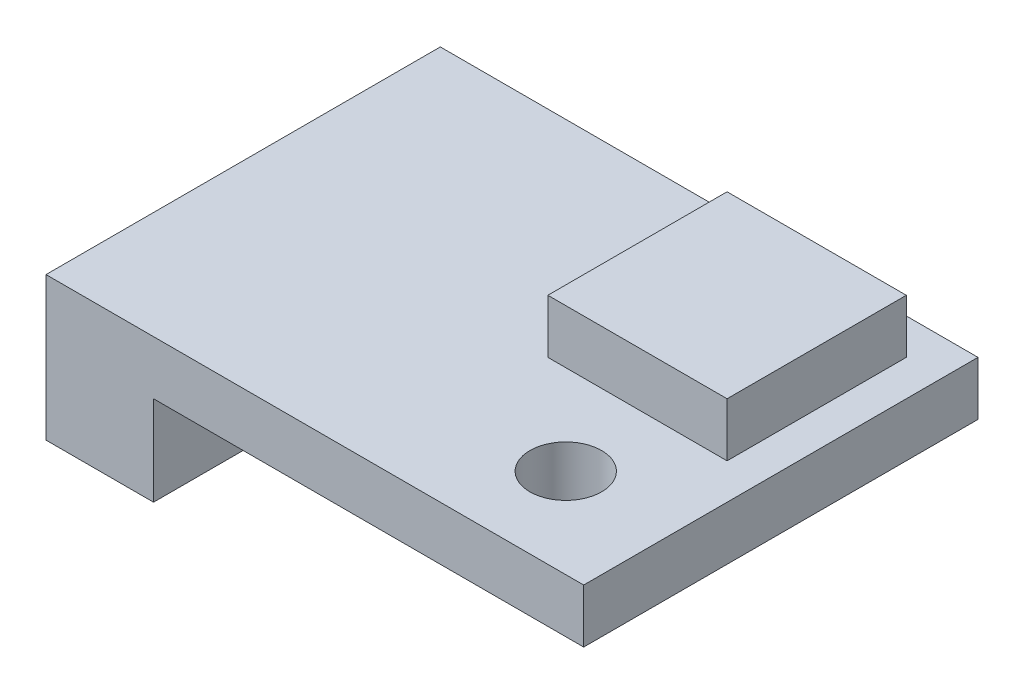
ISO-10303-21;
HEADER;
FILE_DESCRIPTION(('STEP AP214'),'2;1');
FILE_NAME('part.step','',(''),(''),'','','');
FILE_SCHEMA(('AUTOMOTIVE_DESIGN { 1 0 10303 214 1 1 1 1 }'));
ENDSEC;
DATA;
#1=APPLICATION_CONTEXT('core data for automotive mechanical design processes');
#2=APPLICATION_PROTOCOL_DEFINITION('international standard','automotive_design',2000,#1);
#3=PRODUCT_CONTEXT('',#1,'mechanical');
#4=PRODUCT('Part','Part','',(#3));
#5=PRODUCT_RELATED_PRODUCT_CATEGORY('part','',(#4));
#6=PRODUCT_DEFINITION_FORMATION('','',#4);
#7=PRODUCT_DEFINITION_CONTEXT('part definition',#1,'design');
#8=PRODUCT_DEFINITION('design','',#6,#7);
#9=PRODUCT_DEFINITION_SHAPE('','',#8);
#10=(LENGTH_UNIT() NAMED_UNIT(*) SI_UNIT(.MILLI.,.METRE.));
#11=(NAMED_UNIT(*) PLANE_ANGLE_UNIT() SI_UNIT($,.RADIAN.));
#12=(NAMED_UNIT(*) SI_UNIT($,.STERADIAN.) SOLID_ANGLE_UNIT());
#13=UNCERTAINTY_MEASURE_WITH_UNIT(LENGTH_MEASURE(1.E-05),#10,'distance_accuracy_value','');
#14=(GEOMETRIC_REPRESENTATION_CONTEXT(3) GLOBAL_UNCERTAINTY_ASSIGNED_CONTEXT((#13)) GLOBAL_UNIT_ASSIGNED_CONTEXT((#10,
#11,#12)) REPRESENTATION_CONTEXT('',''));
#15=CARTESIAN_POINT('',(0.,0.,0.));
#16=DIRECTION('',(0.,0.,1.));
#17=DIRECTION('',(1.,0.,0.));
#18=AXIS2_PLACEMENT_3D('',#15,#16,#17);
#19=CARTESIAN_POINT('',(0.,1.5,0.));
#20=DIRECTION('',(0.,1.,0.));
#21=DIRECTION('',(0.,0.,1.));
#22=AXIS2_PLACEMENT_3D('',#19,#20,#21);
#23=PLANE('',#22);
#24=DIRECTION('',(-1.,0.,0.));
#25=VECTOR('',#24,1.);
#26=CARTESIAN_POINT('',(0.,1.5,5.5));
#27=LINE('',#26,#25);
#28=CARTESIAN_POINT('',(7.5,1.5,5.5));
#29=VERTEX_POINT('',#28);
#30=CARTESIAN_POINT('',(-7.5,1.5,5.5));
#31=VERTEX_POINT('',#30);
#32=EDGE_CURVE('E198',#29,#31,#27,.T.);
#33=ORIENTED_EDGE('',*,*,#32,.F.);
#34=DIRECTION('',(0.,0.,1.));
#35=VECTOR('',#34,1.);
#36=CARTESIAN_POINT('',(7.5,1.5,0.));
#37=LINE('',#36,#35);
#38=CARTESIAN_POINT('',(7.5,1.5,-5.5));
#39=VERTEX_POINT('',#38);
#40=EDGE_CURVE('E202',#39,#29,#37,.T.);
#41=ORIENTED_EDGE('',*,*,#40,.F.);
#42=DIRECTION('',(-1.,0.,0.));
#43=VECTOR('',#42,1.);
#44=CARTESIAN_POINT('',(0.,1.5,-5.5));
#45=LINE('',#44,#43);
#46=CARTESIAN_POINT('',(-7.5,1.5,-5.5));
#47=VERTEX_POINT('',#46);
#48=EDGE_CURVE('E207',#39,#47,#45,.T.);
#49=ORIENTED_EDGE('',*,*,#48,.T.);
#50=DIRECTION('',(0.,0.,1.));
#51=VECTOR('',#50,1.);
#52=CARTESIAN_POINT('',(-7.5,1.5,0.));
#53=LINE('',#52,#51);
#54=EDGE_CURVE('E210',#47,#31,#53,.T.);
#55=ORIENTED_EDGE('',*,*,#54,.T.);
#56=EDGE_LOOP('',(#33,#41,#49,#55));
#57=FACE_BOUND('',#56,.T.);
#58=CARTESIAN_POINT('',(4.5,1.5,3.));
#59=DIRECTION('',(0.,1.,0.));
#60=DIRECTION('',(0.,0.,1.));
#61=AXIS2_PLACEMENT_3D('',#58,#59,#60);
#62=CIRCLE('',#61,1.);
#63=CARTESIAN_POINT('',(4.5,1.5,4.));
#64=VERTEX_POINT('',#63);
#65=EDGE_CURVE('E213',#64,#64,#62,.T.);
#66=ORIENTED_EDGE('',*,*,#65,.F.);
#67=EDGE_LOOP('',(#66));
#68=FACE_BOUND('',#67,.T.);
#69=DIRECTION('',(1.,0.,0.));
#70=VECTOR('',#69,1.);
#71=CARTESIAN_POINT('',(0.,1.5,-4.5));
#72=LINE('',#71,#70);
#73=CARTESIAN_POINT('',(1.5,1.5,-4.5));
#74=VERTEX_POINT('',#73);
#75=CARTESIAN_POINT('',(6.5,1.5,-4.5));
#76=VERTEX_POINT('',#75);
#77=EDGE_CURVE('E157',#74,#76,#72,.T.);
#78=ORIENTED_EDGE('',*,*,#77,.T.);
#79=DIRECTION('',(0.,0.,-1.));
#80=VECTOR('',#79,1.);
#81=CARTESIAN_POINT('',(6.5,1.5,0.));
#82=LINE('',#81,#80);
#83=CARTESIAN_POINT('',(6.5,1.5,0.499999999999998));
#84=VERTEX_POINT('',#83);
#85=EDGE_CURVE('E138',#84,#76,#82,.T.);
#86=ORIENTED_EDGE('',*,*,#85,.F.);
#87=DIRECTION('',(1.,0.,0.));
#88=VECTOR('',#87,1.);
#89=CARTESIAN_POINT('',(0.,1.5,0.499999999999999));
#90=LINE('',#89,#88);
#91=CARTESIAN_POINT('',(1.5,1.5,0.499999999999999));
#92=VERTEX_POINT('',#91);
#93=EDGE_CURVE('E132',#92,#84,#90,.T.);
#94=ORIENTED_EDGE('',*,*,#93,.F.);
#95=DIRECTION('',(0.,0.,-1.));
#96=VECTOR('',#95,1.);
#97=CARTESIAN_POINT('',(1.5,1.5,0.));
#98=LINE('',#97,#96);
#99=EDGE_CURVE('E57',#92,#74,#98,.T.);
#100=ORIENTED_EDGE('',*,*,#99,.T.);
#101=EDGE_LOOP('',(#78,#86,#94,#100));
#102=FACE_BOUND('',#101,.T.);
#103=ADVANCED_FACE('F41',(#57,#68,#102),#23,.T.);
#104=CARTESIAN_POINT('',(0.,0.,0.));
#105=DIRECTION('',(0.,1.,0.));
#106=DIRECTION('',(0.,0.,1.));
#107=AXIS2_PLACEMENT_3D('',#104,#105,#106);
#108=PLANE('',#107);
#109=CARTESIAN_POINT('',(4.5,0.,3.));
#110=DIRECTION('',(0.,1.,0.));
#111=DIRECTION('',(0.,0.,1.));
#112=AXIS2_PLACEMENT_3D('',#109,#110,#111);
#113=CIRCLE('',#112,1.);
#114=CARTESIAN_POINT('',(4.5,0.,4.));
#115=VERTEX_POINT('',#114);
#116=EDGE_CURVE('E203',#115,#115,#113,.T.);
#117=ORIENTED_EDGE('',*,*,#116,.T.);
#118=EDGE_LOOP('',(#117));
#119=FACE_BOUND('',#118,.T.);
#120=DIRECTION('',(0.,0.,1.));
#121=VECTOR('',#120,1.);
#122=CARTESIAN_POINT('',(-4.5,0.,0.));
#123=LINE('',#122,#121);
#124=CARTESIAN_POINT('',(-4.5,0.,-5.5));
#125=VERTEX_POINT('',#124);
#126=CARTESIAN_POINT('',(-4.5,0.,5.5));
#127=VERTEX_POINT('',#126);
#128=EDGE_CURVE('E65',#125,#127,#123,.T.);
#129=ORIENTED_EDGE('',*,*,#128,.F.);
#130=DIRECTION('',(-1.,0.,0.));
#131=VECTOR('',#130,1.);
#132=CARTESIAN_POINT('',(0.,0.,-5.5));
#133=LINE('',#132,#131);
#134=CARTESIAN_POINT('',(7.5,0.,-5.5));
#135=VERTEX_POINT('',#134);
#136=EDGE_CURVE('E224',#135,#125,#133,.T.);
#137=ORIENTED_EDGE('',*,*,#136,.F.);
#138=DIRECTION('',(0.,0.,1.));
#139=VECTOR('',#138,1.);
#140=CARTESIAN_POINT('',(7.5,0.,0.));
#141=LINE('',#140,#139);
#142=CARTESIAN_POINT('',(7.5,0.,5.5));
#143=VERTEX_POINT('',#142);
#144=EDGE_CURVE('E220',#135,#143,#141,.T.);
#145=ORIENTED_EDGE('',*,*,#144,.T.);
#146=DIRECTION('',(-1.,0.,0.));
#147=VECTOR('',#146,1.);
#148=CARTESIAN_POINT('',(0.,0.,5.5));
#149=LINE('',#148,#147);
#150=EDGE_CURVE('E194',#143,#127,#149,.T.);
#151=ORIENTED_EDGE('',*,*,#150,.T.);
#152=EDGE_LOOP('',(#129,#137,#145,#151));
#153=FACE_BOUND('',#152,.T.);
#154=ADVANCED_FACE('F242',(#119,#153),#108,.F.);
#155=CARTESIAN_POINT('',(0.,1.5,5.5));
#156=DIRECTION('',(0.,0.,1.));
#157=DIRECTION('',(1.,0.,0.));
#158=AXIS2_PLACEMENT_3D('',#155,#156,#157);
#159=PLANE('',#158);
#160=ORIENTED_EDGE('',*,*,#150,.F.);
#161=DIRECTION('',(0.,-1.,0.));
#162=VECTOR('',#161,1.);
#163=CARTESIAN_POINT('',(7.5,1.5,5.5));
#164=LINE('',#163,#162);
#165=EDGE_CURVE('E11',#29,#143,#164,.T.);
#166=ORIENTED_EDGE('',*,*,#165,.F.);
#167=ORIENTED_EDGE('',*,*,#32,.T.);
#168=DIRECTION('',(0.,-1.,0.));
#169=VECTOR('',#168,1.);
#170=CARTESIAN_POINT('',(-7.5,1.5,5.5));
#171=LINE('',#170,#169);
#172=CARTESIAN_POINT('',(-7.5,-2.5,5.5));
#173=VERTEX_POINT('',#172);
#174=EDGE_CURVE('E217',#31,#173,#171,.T.);
#175=ORIENTED_EDGE('',*,*,#174,.T.);
#176=DIRECTION('',(-1.,0.,0.));
#177=VECTOR('',#176,1.);
#178=CARTESIAN_POINT('',(0.,-2.5,5.5));
#179=LINE('',#178,#177);
#180=CARTESIAN_POINT('',(-4.5,-2.5,5.5));
#181=VERTEX_POINT('',#180);
#182=EDGE_CURVE('E183',#181,#173,#179,.T.);
#183=ORIENTED_EDGE('',*,*,#182,.F.);
#184=DIRECTION('',(0.,1.,0.));
#185=VECTOR('',#184,1.);
#186=CARTESIAN_POINT('',(-4.5,-2.5,5.5));
#187=LINE('',#186,#185);
#188=EDGE_CURVE('E190',#181,#127,#187,.T.);
#189=ORIENTED_EDGE('',*,*,#188,.T.);
#190=EDGE_LOOP('',(#160,#166,#167,#175,#183,#189));
#191=FACE_BOUND('',#190,.T.);
#192=ADVANCED_FACE('F43',(#191),#159,.T.);
#193=CARTESIAN_POINT('',(7.5,1.5,0.));
#194=DIRECTION('',(1.,0.,0.));
#195=DIRECTION('',(0.,0.,-1.));
#196=AXIS2_PLACEMENT_3D('',#193,#194,#195);
#197=PLANE('',#196);
#198=ORIENTED_EDGE('',*,*,#144,.F.);
#199=DIRECTION('',(0.,-1.,0.));
#200=VECTOR('',#199,1.);
#201=CARTESIAN_POINT('',(7.5,1.5,-5.5));
#202=LINE('',#201,#200);
#203=EDGE_CURVE('E50',#39,#135,#202,.T.);
#204=ORIENTED_EDGE('',*,*,#203,.F.);
#205=ORIENTED_EDGE('',*,*,#40,.T.);
#206=ORIENTED_EDGE('',*,*,#165,.T.);
#207=EDGE_LOOP('',(#198,#204,#205,#206));
#208=FACE_BOUND('',#207,.T.);
#209=ADVANCED_FACE('F243',(#208),#197,.T.);
#210=CARTESIAN_POINT('',(0.,1.5,-5.5));
#211=DIRECTION('',(0.,0.,1.));
#212=DIRECTION('',(1.,0.,0.));
#213=AXIS2_PLACEMENT_3D('',#210,#211,#212);
#214=PLANE('',#213);
#215=ORIENTED_EDGE('',*,*,#136,.T.);
#216=DIRECTION('',(0.,1.,0.));
#217=VECTOR('',#216,1.);
#218=CARTESIAN_POINT('',(-4.5,-2.5,-5.5));
#219=LINE('',#218,#217);
#220=CARTESIAN_POINT('',(-4.5,-2.5,-5.5));
#221=VERTEX_POINT('',#220);
#222=EDGE_CURVE('E187',#221,#125,#219,.T.);
#223=ORIENTED_EDGE('',*,*,#222,.F.);
#224=DIRECTION('',(-1.,0.,0.));
#225=VECTOR('',#224,1.);
#226=CARTESIAN_POINT('',(0.,-2.5,-5.5));
#227=LINE('',#226,#225);
#228=CARTESIAN_POINT('',(-7.5,-2.5,-5.5));
#229=VERTEX_POINT('',#228);
#230=EDGE_CURVE('E175',#221,#229,#227,.T.);
#231=ORIENTED_EDGE('',*,*,#230,.T.);
#232=DIRECTION('',(0.,-1.,0.));
#233=VECTOR('',#232,1.);
#234=CARTESIAN_POINT('',(-7.5,1.5,-5.5));
#235=LINE('',#234,#233);
#236=EDGE_CURVE('E232',#47,#229,#235,.T.);
#237=ORIENTED_EDGE('',*,*,#236,.F.);
#238=ORIENTED_EDGE('',*,*,#48,.F.);
#239=ORIENTED_EDGE('',*,*,#203,.T.);
#240=EDGE_LOOP('',(#215,#223,#231,#237,#238,#239));
#241=FACE_BOUND('',#240,.T.);
#242=ADVANCED_FACE('F237',(#241),#214,.F.);
#243=CARTESIAN_POINT('',(-7.5,1.5,0.));
#244=DIRECTION('',(1.,0.,0.));
#245=DIRECTION('',(0.,0.,-1.));
#246=AXIS2_PLACEMENT_3D('',#243,#244,#245);
#247=PLANE('',#246);
#248=ORIENTED_EDGE('',*,*,#236,.T.);
#249=DIRECTION('',(0.,0.,1.));
#250=VECTOR('',#249,1.);
#251=CARTESIAN_POINT('',(-7.5,-2.5,0.));
#252=LINE('',#251,#250);
#253=EDGE_CURVE('E179',#229,#173,#252,.T.);
#254=ORIENTED_EDGE('',*,*,#253,.T.);
#255=ORIENTED_EDGE('',*,*,#174,.F.);
#256=ORIENTED_EDGE('',*,*,#54,.F.);
#257=EDGE_LOOP('',(#248,#254,#255,#256));
#258=FACE_BOUND('',#257,.T.);
#259=ADVANCED_FACE('F258',(#258),#247,.F.);
#260=CARTESIAN_POINT('',(4.5,1.5,3.));
#261=DIRECTION('',(0.,-1.,0.));
#262=DIRECTION('',(0.,0.,-1.));
#263=AXIS2_PLACEMENT_3D('',#260,#261,#262);
#264=CYLINDRICAL_SURFACE('',#263,1.);
#265=ORIENTED_EDGE('',*,*,#65,.T.);
#266=EDGE_LOOP('',(#265));
#267=FACE_BOUND('',#266,.T.);
#268=ORIENTED_EDGE('',*,*,#116,.F.);
#269=EDGE_LOOP('',(#268));
#270=FACE_BOUND('',#269,.T.);
#271=ADVANCED_FACE('F284',(#267,#270),#264,.F.);
#272=CARTESIAN_POINT('',(-4.5,-2.5,0.));
#273=DIRECTION('',(-1.,0.,0.));
#274=DIRECTION('',(0.,0.,1.));
#275=AXIS2_PLACEMENT_3D('',#272,#273,#274);
#276=PLANE('',#275);
#277=ORIENTED_EDGE('',*,*,#128,.T.);
#278=ORIENTED_EDGE('',*,*,#188,.F.);
#279=DIRECTION('',(0.,0.,1.));
#280=VECTOR('',#279,1.);
#281=CARTESIAN_POINT('',(-4.5,-2.5,0.));
#282=LINE('',#281,#280);
#283=EDGE_CURVE('E171',#221,#181,#282,.T.);
#284=ORIENTED_EDGE('',*,*,#283,.F.);
#285=ORIENTED_EDGE('',*,*,#222,.T.);
#286=EDGE_LOOP('',(#277,#278,#284,#285));
#287=FACE_BOUND('',#286,.T.);
#288=ADVANCED_FACE('F250',(#287),#276,.F.);
#289=CARTESIAN_POINT('',(0.,-2.5,0.));
#290=DIRECTION('',(0.,1.,0.));
#291=DIRECTION('',(0.,0.,1.));
#292=AXIS2_PLACEMENT_3D('',#289,#290,#291);
#293=PLANE('',#292);
#294=ORIENTED_EDGE('',*,*,#283,.T.);
#295=ORIENTED_EDGE('',*,*,#182,.T.);
#296=ORIENTED_EDGE('',*,*,#253,.F.);
#297=ORIENTED_EDGE('',*,*,#230,.F.);
#298=EDGE_LOOP('',(#294,#295,#296,#297));
#299=FACE_BOUND('',#298,.T.);
#300=ADVANCED_FACE('F255',(#299),#293,.F.);
#301=CARTESIAN_POINT('',(6.5,3.,0.));
#302=DIRECTION('',(-1.,0.,0.));
#303=DIRECTION('',(0.,0.,1.));
#304=AXIS2_PLACEMENT_3D('',#301,#302,#303);
#305=PLANE('',#304);
#306=ORIENTED_EDGE('',*,*,#85,.T.);
#307=DIRECTION('',(0.,-1.,0.));
#308=VECTOR('',#307,1.);
#309=CARTESIAN_POINT('',(6.5,3.,-4.5));
#310=LINE('',#309,#308);
#311=CARTESIAN_POINT('',(6.5,3.,-4.5));
#312=VERTEX_POINT('',#311);
#313=EDGE_CURVE('E135',#312,#76,#310,.T.);
#314=ORIENTED_EDGE('',*,*,#313,.F.);
#315=DIRECTION('',(0.,0.,-1.));
#316=VECTOR('',#315,1.);
#317=CARTESIAN_POINT('',(6.5,3.,0.));
#318=LINE('',#317,#316);
#319=CARTESIAN_POINT('',(6.5,3.,0.499999999999998));
#320=VERTEX_POINT('',#319);
#321=EDGE_CURVE('E119',#320,#312,#318,.T.);
#322=ORIENTED_EDGE('',*,*,#321,.F.);
#323=DIRECTION('',(0.,-1.,0.));
#324=VECTOR('',#323,1.);
#325=CARTESIAN_POINT('',(6.5,3.,0.499999999999998));
#326=LINE('',#325,#324);
#327=EDGE_CURVE('E154',#320,#84,#326,.T.);
#328=ORIENTED_EDGE('',*,*,#327,.T.);
#329=EDGE_LOOP('',(#306,#314,#322,#328));
#330=FACE_BOUND('',#329,.T.);
#331=ADVANCED_FACE('F136',(#330),#305,.F.);
#332=CARTESIAN_POINT('',(0.,3.,-4.5));
#333=DIRECTION('',(0.,0.,-1.));
#334=DIRECTION('',(-1.,0.,0.));
#335=AXIS2_PLACEMENT_3D('',#332,#333,#334);
#336=PLANE('',#335);
#337=ORIENTED_EDGE('',*,*,#77,.F.);
#338=DIRECTION('',(0.,-1.,0.));
#339=VECTOR('',#338,1.);
#340=CARTESIAN_POINT('',(1.5,3.,-4.5));
#341=LINE('',#340,#339);
#342=CARTESIAN_POINT('',(1.5,3.,-4.5));
#343=VERTEX_POINT('',#342);
#344=EDGE_CURVE('E143',#343,#74,#341,.T.);
#345=ORIENTED_EDGE('',*,*,#344,.F.);
#346=DIRECTION('',(1.,0.,0.));
#347=VECTOR('',#346,1.);
#348=CARTESIAN_POINT('',(0.,3.,-4.5));
#349=LINE('',#348,#347);
#350=EDGE_CURVE('E124',#343,#312,#349,.T.);
#351=ORIENTED_EDGE('',*,*,#350,.T.);
#352=ORIENTED_EDGE('',*,*,#313,.T.);
#353=EDGE_LOOP('',(#337,#345,#351,#352));
#354=FACE_BOUND('',#353,.T.);
#355=ADVANCED_FACE('F145',(#354),#336,.T.);
#356=CARTESIAN_POINT('',(1.5,3.,0.));
#357=DIRECTION('',(-1.,0.,0.));
#358=DIRECTION('',(0.,0.,1.));
#359=AXIS2_PLACEMENT_3D('',#356,#357,#358);
#360=PLANE('',#359);
#361=ORIENTED_EDGE('',*,*,#99,.F.);
#362=DIRECTION('',(0.,-1.,0.));
#363=VECTOR('',#362,1.);
#364=CARTESIAN_POINT('',(1.5,3.,0.499999999999999));
#365=LINE('',#364,#363);
#366=CARTESIAN_POINT('',(1.5,3.,0.499999999999999));
#367=VERTEX_POINT('',#366);
#368=EDGE_CURVE('E166',#367,#92,#365,.T.);
#369=ORIENTED_EDGE('',*,*,#368,.F.);
#370=DIRECTION('',(0.,0.,-1.));
#371=VECTOR('',#370,1.);
#372=CARTESIAN_POINT('',(1.5,3.,0.));
#373=LINE('',#372,#371);
#374=EDGE_CURVE('E147',#367,#343,#373,.T.);
#375=ORIENTED_EDGE('',*,*,#374,.T.);
#376=ORIENTED_EDGE('',*,*,#344,.T.);
#377=EDGE_LOOP('',(#361,#369,#375,#376));
#378=FACE_BOUND('',#377,.T.);
#379=ADVANCED_FACE('F268',(#378),#360,.T.);
#380=CARTESIAN_POINT('',(0.,3.,0.499999999999999));
#381=DIRECTION('',(0.,0.,-1.));
#382=DIRECTION('',(-1.,0.,0.));
#383=AXIS2_PLACEMENT_3D('',#380,#381,#382);
#384=PLANE('',#383);
#385=ORIENTED_EDGE('',*,*,#93,.T.);
#386=ORIENTED_EDGE('',*,*,#327,.F.);
#387=DIRECTION('',(1.,0.,0.));
#388=VECTOR('',#387,1.);
#389=CARTESIAN_POINT('',(0.,3.,0.499999999999999));
#390=LINE('',#389,#388);
#391=EDGE_CURVE('E127',#367,#320,#390,.T.);
#392=ORIENTED_EDGE('',*,*,#391,.F.);
#393=ORIENTED_EDGE('',*,*,#368,.T.);
#394=EDGE_LOOP('',(#385,#386,#392,#393));
#395=FACE_BOUND('',#394,.T.);
#396=ADVANCED_FACE('F267',(#395),#384,.F.);
#397=CARTESIAN_POINT('',(0.,3.,0.));
#398=DIRECTION('',(0.,-1.,0.));
#399=DIRECTION('',(0.,0.,-1.));
#400=AXIS2_PLACEMENT_3D('',#397,#398,#399);
#401=PLANE('',#400);
#402=ORIENTED_EDGE('',*,*,#321,.T.);
#403=ORIENTED_EDGE('',*,*,#350,.F.);
#404=ORIENTED_EDGE('',*,*,#374,.F.);
#405=ORIENTED_EDGE('',*,*,#391,.T.);
#406=EDGE_LOOP('',(#402,#403,#404,#405));
#407=FACE_BOUND('',#406,.T.);
#408=ADVANCED_FACE('F121',(#407),#401,.F.);
#409=CLOSED_SHELL('',(#103,#154,#192,#209,#242,#259,#271,#288,#300,#331,#355,#379,#396,#408));
#410=MANIFOLD_SOLID_BREP('B2',#409);
#411=ADVANCED_BREP_SHAPE_REPRESENTATION('',(#18,#410),#14);
#412=SHAPE_DEFINITION_REPRESENTATION(#9,#411);
ENDSEC;
END-ISO-10303-21;
